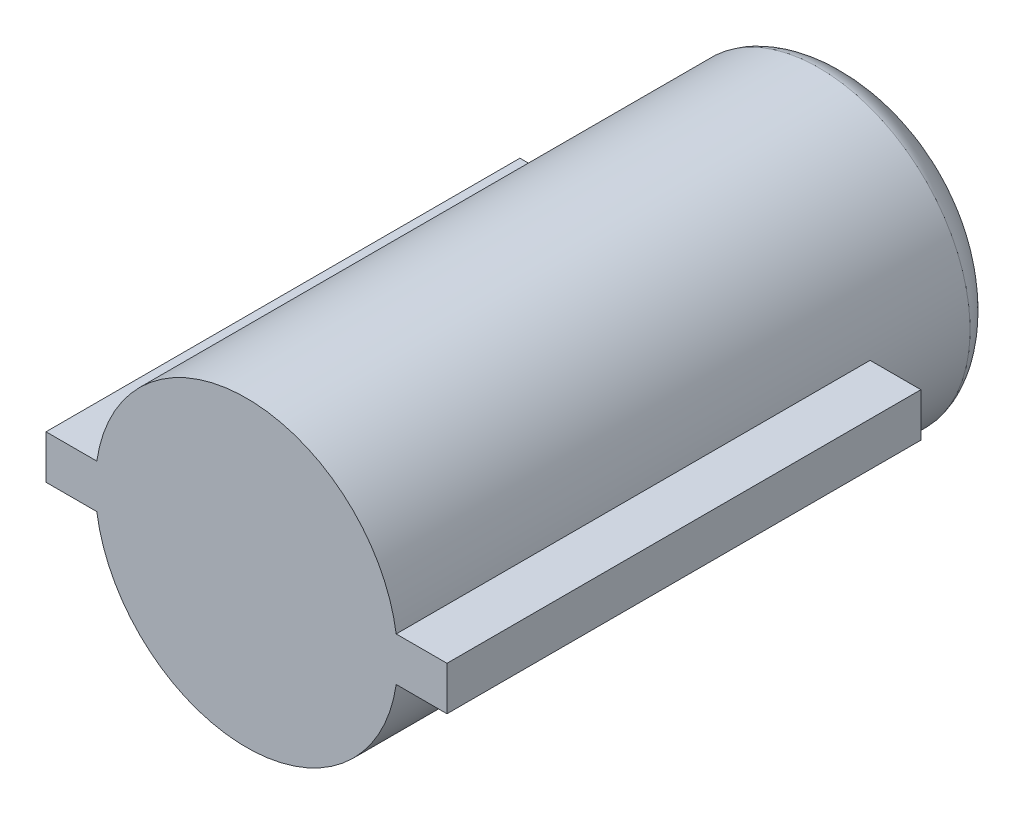
ISO-10303-21;
HEADER;
FILE_DESCRIPTION(('STEP AP214'),'2;1');
FILE_NAME('part.step','',(''),(''),'','','');
FILE_SCHEMA(('AUTOMOTIVE_DESIGN { 1 0 10303 214 1 1 1 1 }'));
ENDSEC;
DATA;
#1=APPLICATION_CONTEXT('core data for automotive mechanical design processes');
#2=APPLICATION_PROTOCOL_DEFINITION('international standard','automotive_design',2000,#1);
#3=PRODUCT_CONTEXT('',#1,'mechanical');
#4=PRODUCT('Part','Part','',(#3));
#5=PRODUCT_RELATED_PRODUCT_CATEGORY('part','',(#4));
#6=PRODUCT_DEFINITION_FORMATION('','',#4);
#7=PRODUCT_DEFINITION_CONTEXT('part definition',#1,'design');
#8=PRODUCT_DEFINITION('design','',#6,#7);
#9=PRODUCT_DEFINITION_SHAPE('','',#8);
#10=(LENGTH_UNIT() NAMED_UNIT(*) SI_UNIT(.MILLI.,.METRE.));
#11=(NAMED_UNIT(*) PLANE_ANGLE_UNIT() SI_UNIT($,.RADIAN.));
#12=(NAMED_UNIT(*) SI_UNIT($,.STERADIAN.) SOLID_ANGLE_UNIT());
#13=UNCERTAINTY_MEASURE_WITH_UNIT(LENGTH_MEASURE(1.E-05),#10,'distance_accuracy_value','');
#14=(GEOMETRIC_REPRESENTATION_CONTEXT(3) GLOBAL_UNCERTAINTY_ASSIGNED_CONTEXT((#13)) GLOBAL_UNIT_ASSIGNED_CONTEXT((#10,
#11,#12)) REPRESENTATION_CONTEXT('',''));
#15=CARTESIAN_POINT('',(0.,0.,0.));
#16=DIRECTION('',(0.,0.,1.));
#17=DIRECTION('',(1.,0.,0.));
#18=AXIS2_PLACEMENT_3D('',#15,#16,#17);
#19=CARTESIAN_POINT('',(0.,0.,17.2));
#20=DIRECTION('',(0.,0.,-1.));
#21=DIRECTION('',(-1.,0.,0.));
#22=AXIS2_PLACEMENT_3D('',#19,#20,#21);
#23=CYLINDRICAL_SURFACE('',#22,4.15);
#24=CARTESIAN_POINT('',(0.,0.,1.50000000000001));
#25=DIRECTION('',(0.,0.,-1.));
#26=DIRECTION('',(-1.,0.,0.));
#27=AXIS2_PLACEMENT_3D('',#24,#25,#26);
#28=CIRCLE('',#27,4.15);
#29=CARTESIAN_POINT('',(-4.15,0.,1.50000000000001));
#30=VERTEX_POINT('',#29);
#31=EDGE_CURVE('E141',#30,#30,#28,.T.);
#32=ORIENTED_EDGE('',*,*,#31,.F.);
#33=EDGE_LOOP('',(#32));
#34=FACE_BOUND('',#33,.T.);
#35=CARTESIAN_POINT('',(0.,0.,4.2));
#36=DIRECTION('',(0.,0.,1.));
#37=DIRECTION('',(1.,0.,0.));
#38=AXIS2_PLACEMENT_3D('',#35,#36,#37);
#39=CIRCLE('',#38,4.15);
#40=CARTESIAN_POINT('',(-4.10639744788543,0.599999999999999,4.2));
#41=VERTEX_POINT('',#40);
#42=CARTESIAN_POINT('',(-4.10639744788543,-0.600000000000001,4.2));
#43=VERTEX_POINT('',#42);
#44=EDGE_CURVE('E11',#41,#43,#39,.T.);
#45=ORIENTED_EDGE('',*,*,#44,.F.);
#46=DIRECTION('',(0.,0.,-1.));
#47=VECTOR('',#46,1.);
#48=CARTESIAN_POINT('',(-4.10639744788543,0.599999999999999,17.2));
#49=LINE('',#48,#47);
#50=CARTESIAN_POINT('',(-4.10639744788543,0.599999999999999,17.2));
#51=VERTEX_POINT('',#50);
#52=EDGE_CURVE('E174',#41,#51,#49,.F.);
#53=ORIENTED_EDGE('',*,*,#52,.T.);
#54=CARTESIAN_POINT('',(0.,0.,17.2));
#55=DIRECTION('',(0.,0.,1.));
#56=DIRECTION('',(1.,0.,0.));
#57=AXIS2_PLACEMENT_3D('',#54,#55,#56);
#58=CIRCLE('',#57,4.15);
#59=CARTESIAN_POINT('',(4.10639744788543,0.6,17.2));
#60=VERTEX_POINT('',#59);
#61=EDGE_CURVE('E182',#60,#51,#58,.T.);
#62=ORIENTED_EDGE('',*,*,#61,.F.);
#63=DIRECTION('',(0.,0.,-1.));
#64=VECTOR('',#63,1.);
#65=CARTESIAN_POINT('',(4.10639744788543,0.6,17.2));
#66=LINE('',#65,#64);
#67=CARTESIAN_POINT('',(4.10639744788543,0.6,4.2));
#68=VERTEX_POINT('',#67);
#69=EDGE_CURVE('E178',#60,#68,#66,.T.);
#70=ORIENTED_EDGE('',*,*,#69,.T.);
#71=CARTESIAN_POINT('',(4.10639744788543,-0.6,4.2));
#72=VERTEX_POINT('',#71);
#73=EDGE_CURVE('E43',#72,#68,#39,.T.);
#74=ORIENTED_EDGE('',*,*,#73,.F.);
#75=DIRECTION('',(0.,0.,-1.));
#76=VECTOR('',#75,1.);
#77=CARTESIAN_POINT('',(4.10639744788543,-0.599999999999999,17.2));
#78=LINE('',#77,#76);
#79=CARTESIAN_POINT('',(4.10639744788543,-0.6,17.2));
#80=VERTEX_POINT('',#79);
#81=EDGE_CURVE('E162',#72,#80,#78,.F.);
#82=ORIENTED_EDGE('',*,*,#81,.T.);
#83=CARTESIAN_POINT('',(-4.10639744788543,-0.600000000000001,17.2));
#84=VERTEX_POINT('',#83);
#85=EDGE_CURVE('E181',#84,#80,#58,.T.);
#86=ORIENTED_EDGE('',*,*,#85,.F.);
#87=DIRECTION('',(0.,0.,-1.));
#88=VECTOR('',#87,1.);
#89=CARTESIAN_POINT('',(-4.10639744788543,-0.6,17.2));
#90=LINE('',#89,#88);
#91=EDGE_CURVE('E171',#84,#43,#90,.T.);
#92=ORIENTED_EDGE('',*,*,#91,.T.);
#93=EDGE_LOOP('',(#45,#53,#62,#70,#74,#82,#86,#92));
#94=FACE_BOUND('',#93,.T.);
#95=ADVANCED_FACE('F40',(#34,#94),#23,.T.);
#96=CARTESIAN_POINT('',(0.,0.,17.2));
#97=DIRECTION('',(0.,0.,1.));
#98=DIRECTION('',(1.,0.,0.));
#99=AXIS2_PLACEMENT_3D('',#96,#97,#98);
#100=PLANE('',#99);
#101=ORIENTED_EDGE('',*,*,#85,.T.);
#102=DIRECTION('',(1.,0.,0.));
#103=VECTOR('',#102,1.);
#104=CARTESIAN_POINT('',(5.5,-0.599999999999999,17.2));
#105=LINE('',#104,#103);
#106=CARTESIAN_POINT('',(5.5,-0.599999999999999,17.2));
#107=VERTEX_POINT('',#106);
#108=EDGE_CURVE('E154',#80,#107,#105,.T.);
#109=ORIENTED_EDGE('',*,*,#108,.T.);
#110=DIRECTION('',(0.,1.,0.));
#111=VECTOR('',#110,1.);
#112=CARTESIAN_POINT('',(5.5,-0.599999999999999,17.2));
#113=LINE('',#112,#111);
#114=CARTESIAN_POINT('',(5.5,0.600000000000001,17.2));
#115=VERTEX_POINT('',#114);
#116=EDGE_CURVE('E157',#107,#115,#113,.T.);
#117=ORIENTED_EDGE('',*,*,#116,.T.);
#118=DIRECTION('',(-1.,0.,0.));
#119=VECTOR('',#118,1.);
#120=CARTESIAN_POINT('',(5.5,0.600000000000001,17.2));
#121=LINE('',#120,#119);
#122=EDGE_CURVE('E62',#115,#60,#121,.T.);
#123=ORIENTED_EDGE('',*,*,#122,.T.);
#124=ORIENTED_EDGE('',*,*,#61,.T.);
#125=CARTESIAN_POINT('',(-5.5,0.599999999999999,17.2));
#126=VERTEX_POINT('',#125);
#127=EDGE_CURVE('E138',#51,#126,#121,.T.);
#128=ORIENTED_EDGE('',*,*,#127,.T.);
#129=DIRECTION('',(0.,-1.,0.));
#130=VECTOR('',#129,1.);
#131=CARTESIAN_POINT('',(-5.5,-0.600000000000001,17.2));
#132=LINE('',#131,#130);
#133=CARTESIAN_POINT('',(-5.5,-0.600000000000001,17.2));
#134=VERTEX_POINT('',#133);
#135=EDGE_CURVE('E151',#126,#134,#132,.T.);
#136=ORIENTED_EDGE('',*,*,#135,.T.);
#137=EDGE_CURVE('E55',#134,#84,#105,.T.);
#138=ORIENTED_EDGE('',*,*,#137,.T.);
#139=EDGE_LOOP('',(#101,#109,#117,#123,#124,#128,#136,#138));
#140=FACE_BOUND('',#139,.T.);
#141=ADVANCED_FACE('F188',(#140),#100,.T.);
#142=CARTESIAN_POINT('',(5.5,-0.599999999999999,4.2));
#143=DIRECTION('',(1.,0.,0.));
#144=DIRECTION('',(0.,0.,-1.));
#145=AXIS2_PLACEMENT_3D('',#142,#143,#144);
#146=PLANE('',#145);
#147=ORIENTED_EDGE('',*,*,#116,.F.);
#148=DIRECTION('',(0.,0.,1.));
#149=VECTOR('',#148,1.);
#150=CARTESIAN_POINT('',(5.5,-0.599999999999999,4.2));
#151=LINE('',#150,#149);
#152=CARTESIAN_POINT('',(5.5,-0.599999999999999,4.2));
#153=VERTEX_POINT('',#152);
#154=EDGE_CURVE('E115',#153,#107,#151,.T.);
#155=ORIENTED_EDGE('',*,*,#154,.F.);
#156=DIRECTION('',(0.,1.,0.));
#157=VECTOR('',#156,1.);
#158=CARTESIAN_POINT('',(5.5,-0.599999999999999,4.2));
#159=LINE('',#158,#157);
#160=CARTESIAN_POINT('',(5.5,0.600000000000001,4.2));
#161=VERTEX_POINT('',#160);
#162=EDGE_CURVE('E125',#153,#161,#159,.T.);
#163=ORIENTED_EDGE('',*,*,#162,.T.);
#164=DIRECTION('',(0.,0.,1.));
#165=VECTOR('',#164,1.);
#166=CARTESIAN_POINT('',(5.5,0.600000000000001,4.2));
#167=LINE('',#166,#165);
#168=EDGE_CURVE('E163',#161,#115,#167,.T.);
#169=ORIENTED_EDGE('',*,*,#168,.T.);
#170=EDGE_LOOP('',(#147,#155,#163,#169));
#171=FACE_BOUND('',#170,.T.);
#172=ADVANCED_FACE('F201',(#171),#146,.T.);
#173=CARTESIAN_POINT('',(0.,0.,4.2));
#174=DIRECTION('',(0.,0.,1.));
#175=DIRECTION('',(1.,0.,0.));
#176=AXIS2_PLACEMENT_3D('',#173,#174,#175);
#177=PLANE('',#176);
#178=DIRECTION('',(1.,0.,0.));
#179=VECTOR('',#178,1.);
#180=CARTESIAN_POINT('',(5.5,-0.599999999999999,4.2));
#181=LINE('',#180,#179);
#182=EDGE_CURVE('E126',#72,#153,#181,.T.);
#183=ORIENTED_EDGE('',*,*,#182,.F.);
#184=ORIENTED_EDGE('',*,*,#73,.T.);
#185=DIRECTION('',(-1.,0.,0.));
#186=VECTOR('',#185,1.);
#187=CARTESIAN_POINT('',(5.5,0.600000000000001,4.2));
#188=LINE('',#187,#186);
#189=EDGE_CURVE('E116',#161,#68,#188,.T.);
#190=ORIENTED_EDGE('',*,*,#189,.F.);
#191=ORIENTED_EDGE('',*,*,#162,.F.);
#192=EDGE_LOOP('',(#183,#184,#190,#191));
#193=FACE_BOUND('',#192,.T.);
#194=ADVANCED_FACE('F197',(#193),#177,.F.);
#195=CARTESIAN_POINT('',(5.5,-0.599999999999999,4.2));
#196=DIRECTION('',(0.,-1.,0.));
#197=DIRECTION('',(1.,0.,0.));
#198=AXIS2_PLACEMENT_3D('',#195,#196,#197);
#199=PLANE('',#198);
#200=ORIENTED_EDGE('',*,*,#81,.F.);
#201=ORIENTED_EDGE('',*,*,#182,.T.);
#202=ORIENTED_EDGE('',*,*,#154,.T.);
#203=ORIENTED_EDGE('',*,*,#108,.F.);
#204=EDGE_LOOP('',(#200,#201,#202,#203));
#205=FACE_BOUND('',#204,.T.);
#206=ADVANCED_FACE('F193',(#205),#199,.T.);
#207=CARTESIAN_POINT('',(5.5,0.600000000000001,4.2));
#208=DIRECTION('',(0.,1.,0.));
#209=DIRECTION('',(-1.,0.,0.));
#210=AXIS2_PLACEMENT_3D('',#207,#208,#209);
#211=PLANE('',#210);
#212=ORIENTED_EDGE('',*,*,#69,.F.);
#213=ORIENTED_EDGE('',*,*,#122,.F.);
#214=ORIENTED_EDGE('',*,*,#168,.F.);
#215=ORIENTED_EDGE('',*,*,#189,.T.);
#216=EDGE_LOOP('',(#212,#213,#214,#215));
#217=FACE_BOUND('',#216,.T.);
#218=ADVANCED_FACE('F203',(#217),#211,.T.);
#219=CARTESIAN_POINT('',(-5.5,0.599999999999999,4.2));
#220=VERTEX_POINT('',#219);
#221=EDGE_CURVE('E147',#41,#220,#188,.T.);
#222=ORIENTED_EDGE('',*,*,#221,.F.);
#223=ORIENTED_EDGE('',*,*,#44,.T.);
#224=CARTESIAN_POINT('',(-5.5,-0.600000000000001,4.2));
#225=VERTEX_POINT('',#224);
#226=EDGE_CURVE('E109',#225,#43,#181,.T.);
#227=ORIENTED_EDGE('',*,*,#226,.F.);
#228=DIRECTION('',(0.,-1.,0.));
#229=VECTOR('',#228,1.);
#230=CARTESIAN_POINT('',(-5.5,-0.600000000000001,4.2));
#231=LINE('',#230,#229);
#232=EDGE_CURVE('E122',#220,#225,#231,.T.);
#233=ORIENTED_EDGE('',*,*,#232,.F.);
#234=EDGE_LOOP('',(#222,#223,#227,#233));
#235=FACE_BOUND('',#234,.T.);
#236=ADVANCED_FACE('F121',(#235),#177,.F.);
#237=ORIENTED_EDGE('',*,*,#52,.F.);
#238=ORIENTED_EDGE('',*,*,#221,.T.);
#239=DIRECTION('',(0.,0.,1.));
#240=VECTOR('',#239,1.);
#241=CARTESIAN_POINT('',(-5.5,0.599999999999999,4.2));
#242=LINE('',#241,#240);
#243=EDGE_CURVE('E131',#220,#126,#242,.T.);
#244=ORIENTED_EDGE('',*,*,#243,.T.);
#245=ORIENTED_EDGE('',*,*,#127,.F.);
#246=EDGE_LOOP('',(#237,#238,#244,#245));
#247=FACE_BOUND('',#246,.T.);
#248=ADVANCED_FACE('F205',(#247),#211,.T.);
#249=ORIENTED_EDGE('',*,*,#91,.F.);
#250=ORIENTED_EDGE('',*,*,#137,.F.);
#251=DIRECTION('',(0.,0.,1.));
#252=VECTOR('',#251,1.);
#253=CARTESIAN_POINT('',(-5.5,-0.600000000000001,4.2));
#254=LINE('',#253,#252);
#255=EDGE_CURVE('E106',#225,#134,#254,.T.);
#256=ORIENTED_EDGE('',*,*,#255,.F.);
#257=ORIENTED_EDGE('',*,*,#226,.T.);
#258=EDGE_LOOP('',(#249,#250,#256,#257));
#259=FACE_BOUND('',#258,.T.);
#260=ADVANCED_FACE('F108',(#259),#199,.T.);
#261=CARTESIAN_POINT('',(-5.5,-0.600000000000001,4.2));
#262=DIRECTION('',(-1.,0.,0.));
#263=DIRECTION('',(0.,0.,1.));
#264=AXIS2_PLACEMENT_3D('',#261,#262,#263);
#265=PLANE('',#264);
#266=ORIENTED_EDGE('',*,*,#135,.F.);
#267=ORIENTED_EDGE('',*,*,#243,.F.);
#268=ORIENTED_EDGE('',*,*,#232,.T.);
#269=ORIENTED_EDGE('',*,*,#255,.T.);
#270=EDGE_LOOP('',(#266,#267,#268,#269));
#271=FACE_BOUND('',#270,.T.);
#272=ADVANCED_FACE('F129',(#271),#265,.T.);
#273=CARTESIAN_POINT('',(0.,4.15,1.50000000000001));
#274=CARTESIAN_POINT('',(0.,4.05537317860218,0.922815805737262));
#275=CARTESIAN_POINT('',(0.,2.84655662610956,-0.00317399949750981));
#276=CARTESIAN_POINT('',(0.,1.43187539710622,0.));
#277=B_SPLINE_CURVE_WITH_KNOTS('',3,(#273,#274,#275,#276),.UNSPECIFIED.,.F.,.F.,(4,4),(0.,
0.91074495904114),.UNSPECIFIED.);
#278=CARTESIAN_POINT('',(0.,0.,0.));
#279=DIRECTION('',(0.,0.,-1.));
#280=AXIS1_PLACEMENT('',#278,#279);
#281=SURFACE_OF_REVOLUTION('',#277,#280);
#282=CARTESIAN_POINT('',(0.,0.,0.));
#283=DIRECTION('',(0.,0.,-1.));
#284=DIRECTION('',(-1.,0.,0.));
#285=AXIS2_PLACEMENT_3D('',#282,#283,#284);
#286=CIRCLE('',#285,1.43187539710622);
#287=CARTESIAN_POINT('',(-1.43187539710622,0.,0.));
#288=VERTEX_POINT('',#287);
#289=EDGE_CURVE('E209',#288,#288,#286,.T.);
#290=ORIENTED_EDGE('',*,*,#289,.F.);
#291=EDGE_LOOP('',(#290));
#292=FACE_BOUND('',#291,.T.);
#293=ORIENTED_EDGE('',*,*,#31,.T.);
#294=EDGE_LOOP('',(#293));
#295=FACE_BOUND('',#294,.T.);
#296=ADVANCED_FACE('F215',(#292,#295),#281,.T.);
#297=CARTESIAN_POINT('',(0.,0.,0.));
#298=DIRECTION('',(0.,0.,1.));
#299=DIRECTION('',(1.,0.,0.));
#300=AXIS2_PLACEMENT_3D('',#297,#298,#299);
#301=PLANE('',#300);
#302=ORIENTED_EDGE('',*,*,#289,.T.);
#303=EDGE_LOOP('',(#302));
#304=FACE_BOUND('',#303,.T.);
#305=ADVANCED_FACE('F228',(#304),#301,.F.);
#306=CLOSED_SHELL('',(#95,#141,#172,#194,#206,#218,#236,#248,#260,#272,#296,#305));
#307=MANIFOLD_SOLID_BREP('B2',#306);
#308=ADVANCED_BREP_SHAPE_REPRESENTATION('',(#18,#307),#14);
#309=SHAPE_DEFINITION_REPRESENTATION(#9,#308);
ENDSEC;
END-ISO-10303-21;
